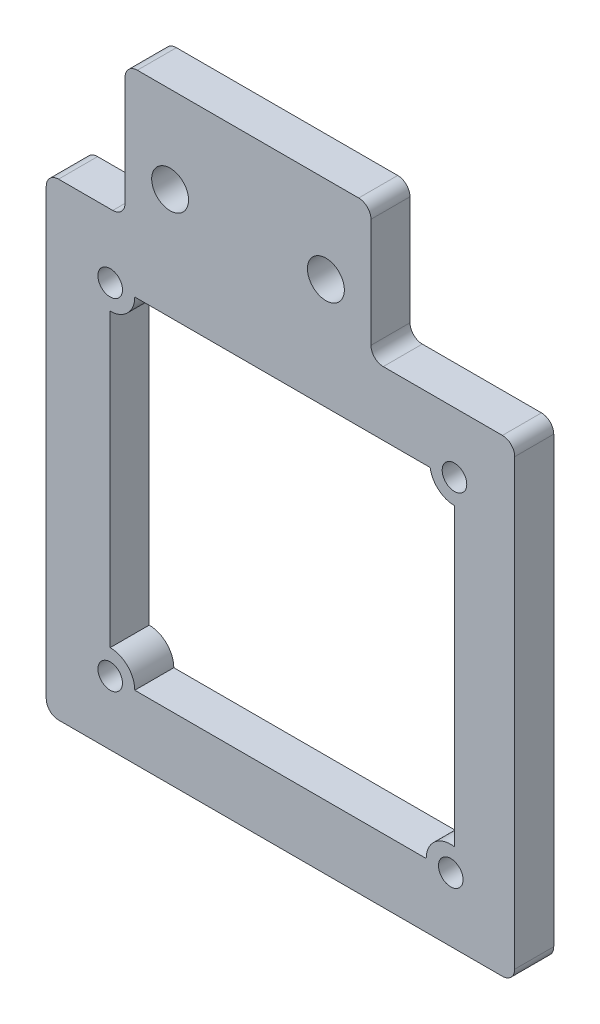
ISO-10303-21;
HEADER;
FILE_DESCRIPTION(('STEP AP214'),'2;1');
FILE_NAME('part.step','',(''),(''),'','','');
FILE_SCHEMA(('AUTOMOTIVE_DESIGN { 1 0 10303 214 1 1 1 1 }'));
ENDSEC;
DATA;
#1=APPLICATION_CONTEXT('core data for automotive mechanical design processes');
#2=APPLICATION_PROTOCOL_DEFINITION('international standard','automotive_design',2000,#1);
#3=PRODUCT_CONTEXT('',#1,'mechanical');
#4=PRODUCT('Part','Part','',(#3));
#5=PRODUCT_RELATED_PRODUCT_CATEGORY('part','',(#4));
#6=PRODUCT_DEFINITION_FORMATION('','',#4);
#7=PRODUCT_DEFINITION_CONTEXT('part definition',#1,'design');
#8=PRODUCT_DEFINITION('design','',#6,#7);
#9=PRODUCT_DEFINITION_SHAPE('','',#8);
#10=(LENGTH_UNIT() NAMED_UNIT(*) SI_UNIT(.MILLI.,.METRE.));
#11=(NAMED_UNIT(*) PLANE_ANGLE_UNIT() SI_UNIT($,.RADIAN.));
#12=(NAMED_UNIT(*) SI_UNIT($,.STERADIAN.) SOLID_ANGLE_UNIT());
#13=UNCERTAINTY_MEASURE_WITH_UNIT(LENGTH_MEASURE(1.E-05),#10,'distance_accuracy_value','');
#14=(GEOMETRIC_REPRESENTATION_CONTEXT(3) GLOBAL_UNCERTAINTY_ASSIGNED_CONTEXT((#13)) GLOBAL_UNIT_ASSIGNED_CONTEXT((#10,
#11,#12)) REPRESENTATION_CONTEXT('',''));
#15=CARTESIAN_POINT('',(0.,0.,0.));
#16=DIRECTION('',(0.,0.,1.));
#17=DIRECTION('',(1.,0.,0.));
#18=AXIS2_PLACEMENT_3D('',#15,#16,#17);
#19=CARTESIAN_POINT('',(0.,0.,3.175));
#20=DIRECTION('',(0.,0.,1.));
#21=DIRECTION('',(1.,0.,0.));
#22=AXIS2_PLACEMENT_3D('',#19,#20,#21);
#23=PLANE('',#22);
#24=CARTESIAN_POINT('',(-1.20910547078258,-5.19999999999999,3.175));
#25=DIRECTION('',(0.,0.,1.));
#26=DIRECTION('',(1.,0.,0.));
#27=AXIS2_PLACEMENT_3D('',#24,#25,#26);
#28=CIRCLE('',#27,1.);
#29=CARTESIAN_POINT('',(-0.209105470782583,-5.19999999999999,3.175));
#30=VERTEX_POINT('',#29);
#31=EDGE_CURVE('E905',#30,#30,#28,.T.);
#32=ORIENTED_EDGE('',*,*,#31,.F.);
#33=EDGE_LOOP('',(#32));
#34=FACE_BOUND('',#33,.T.);
#35=CARTESIAN_POINT('',(3.66495523115076,3.81159322250824,3.175));
#36=DIRECTION('',(0.,0.,1.));
#37=DIRECTION('',(1.,0.,0.));
#38=AXIS2_PLACEMENT_3D('',#35,#36,#37);
#39=CIRCLE('',#38,1.49999999999998);
#40=CARTESIAN_POINT('',(5.16495523115074,3.81159322250824,3.175));
#41=VERTEX_POINT('',#40);
#42=EDGE_CURVE('E590',#41,#41,#39,.T.);
#43=ORIENTED_EDGE('',*,*,#42,.F.);
#44=EDGE_LOOP('',(#43));
#45=FACE_BOUND('',#44,.T.);
#46=CARTESIAN_POINT('',(-1.20910547078258,-32.9,3.175));
#47=DIRECTION('',(0.,0.,1.));
#48=DIRECTION('',(1.,0.,0.));
#49=AXIS2_PLACEMENT_3D('',#46,#47,#48);
#50=CIRCLE('',#49,1.);
#51=CARTESIAN_POINT('',(-0.209105470782583,-32.9,3.175));
#52=VERTEX_POINT('',#51);
#53=EDGE_CURVE('E602',#52,#52,#50,.T.);
#54=ORIENTED_EDGE('',*,*,#53,.F.);
#55=EDGE_LOOP('',(#54));
#56=FACE_BOUND('',#55,.T.);
#57=DIRECTION('',(0.,-1.,0.));
#58=VECTOR('',#57,1.);
#59=CARTESIAN_POINT('',(20.,10.8755385296888,3.175));
#60=LINE('',#59,#58);
#61=CARTESIAN_POINT('',(20.,9.87553852968881,3.175));
#62=VERTEX_POINT('',#61);
#63=CARTESIAN_POINT('',(20.,1.,3.175));
#64=VERTEX_POINT('',#63);
#65=EDGE_CURVE('E628',#62,#64,#60,.T.);
#66=ORIENTED_EDGE('',*,*,#65,.F.);
#67=CARTESIAN_POINT('',(19.,9.87553852968881,3.175));
#68=DIRECTION('',(0.,0.,1.));
#69=DIRECTION('',(1.,0.,0.));
#70=AXIS2_PLACEMENT_3D('',#67,#68,#69);
#71=CIRCLE('',#70,1.);
#72=CARTESIAN_POINT('',(19.,10.8755385296888,3.175));
#73=VERTEX_POINT('',#72);
#74=EDGE_CURVE('E688',#62,#73,#71,.T.);
#75=ORIENTED_EDGE('',*,*,#74,.T.);
#76=DIRECTION('',(-1.,0.,0.));
#77=VECTOR('',#76,1.);
#78=CARTESIAN_POINT('',(20.,10.8755385296888,3.175));
#79=LINE('',#78,#77);
#80=CARTESIAN_POINT('',(1.,10.8755385296888,3.175));
#81=VERTEX_POINT('',#80);
#82=EDGE_CURVE('E608',#73,#81,#79,.T.);
#83=ORIENTED_EDGE('',*,*,#82,.T.);
#84=CARTESIAN_POINT('',(1.,9.87553852968881,3.175));
#85=DIRECTION('',(0.,0.,1.));
#86=DIRECTION('',(1.,0.,0.));
#87=AXIS2_PLACEMENT_3D('',#84,#85,#86);
#88=CIRCLE('',#87,1.);
#89=CARTESIAN_POINT('',(0.,9.87553852968881,3.175));
#90=VERTEX_POINT('',#89);
#91=EDGE_CURVE('E686',#81,#90,#88,.T.);
#92=ORIENTED_EDGE('',*,*,#91,.T.);
#93=DIRECTION('',(0.,-1.,0.));
#94=VECTOR('',#93,1.);
#95=CARTESIAN_POINT('',(0.,10.8755385296888,3.175));
#96=LINE('',#95,#94);
#97=CARTESIAN_POINT('',(0.,1.,3.175));
#98=VERTEX_POINT('',#97);
#99=EDGE_CURVE('E611',#90,#98,#96,.T.);
#100=ORIENTED_EDGE('',*,*,#99,.T.);
#101=CARTESIAN_POINT('',(-1.,1.,3.175));
#102=DIRECTION('',(0.,0.,1.));
#103=DIRECTION('',(1.,0.,0.));
#104=AXIS2_PLACEMENT_3D('',#101,#102,#103);
#105=CIRCLE('',#104,1.);
#106=CARTESIAN_POINT('',(-1.,0.,3.175));
#107=VERTEX_POINT('',#106);
#108=EDGE_CURVE('E12',#98,#107,#105,.F.);
#109=ORIENTED_EDGE('',*,*,#108,.T.);
#110=DIRECTION('',(-1.,0.,0.));
#111=VECTOR('',#110,1.);
#112=CARTESIAN_POINT('',(0.,0.,3.175));
#113=LINE('',#112,#111);
#114=CARTESIAN_POINT('',(-5.40910547078259,0.,3.175));
#115=VERTEX_POINT('',#114);
#116=EDGE_CURVE('E615',#107,#115,#113,.T.);
#117=ORIENTED_EDGE('',*,*,#116,.T.);
#118=CARTESIAN_POINT('',(-5.40910547078259,-0.999999999999994,3.175));
#119=DIRECTION('',(0.,0.,1.));
#120=DIRECTION('',(1.,0.,0.));
#121=AXIS2_PLACEMENT_3D('',#118,#119,#120);
#122=CIRCLE('',#121,1.);
#123=CARTESIAN_POINT('',(-6.40910547078259,-0.999999999999994,3.175));
#124=VERTEX_POINT('',#123);
#125=EDGE_CURVE('E684',#115,#124,#122,.T.);
#126=ORIENTED_EDGE('',*,*,#125,.T.);
#127=DIRECTION('',(0.,-1.,0.));
#128=VECTOR('',#127,1.);
#129=CARTESIAN_POINT('',(-6.40910547078259,0.,3.175));
#130=LINE('',#129,#128);
#131=CARTESIAN_POINT('',(-6.40910547078259,-37.1,3.175));
#132=VERTEX_POINT('',#131);
#133=EDGE_CURVE('E618',#124,#132,#130,.T.);
#134=ORIENTED_EDGE('',*,*,#133,.T.);
#135=CARTESIAN_POINT('',(-5.40910547078259,-37.1,3.175));
#136=DIRECTION('',(0.,0.,1.));
#137=DIRECTION('',(1.,0.,0.));
#138=AXIS2_PLACEMENT_3D('',#135,#136,#137);
#139=CIRCLE('',#138,1.);
#140=CARTESIAN_POINT('',(-5.40910547078259,-38.1,3.175));
#141=VERTEX_POINT('',#140);
#142=EDGE_CURVE('E682',#132,#141,#139,.T.);
#143=ORIENTED_EDGE('',*,*,#142,.T.);
#144=DIRECTION('',(1.,0.,0.));
#145=VECTOR('',#144,1.);
#146=CARTESIAN_POINT('',(-6.40910547078259,-38.1,3.175));
#147=LINE('',#146,#145);
#148=CARTESIAN_POINT('',(30.6908945292174,-38.1,3.175));
#149=VERTEX_POINT('',#148);
#150=EDGE_CURVE('E621',#141,#149,#147,.T.);
#151=ORIENTED_EDGE('',*,*,#150,.T.);
#152=CARTESIAN_POINT('',(30.6908945292174,-37.1,3.175));
#153=DIRECTION('',(0.,0.,1.));
#154=DIRECTION('',(1.,0.,0.));
#155=AXIS2_PLACEMENT_3D('',#152,#153,#154);
#156=CIRCLE('',#155,1.);
#157=CARTESIAN_POINT('',(31.6908945292174,-37.1,3.175));
#158=VERTEX_POINT('',#157);
#159=EDGE_CURVE('E372',#149,#158,#156,.T.);
#160=ORIENTED_EDGE('',*,*,#159,.T.);
#161=DIRECTION('',(0.,1.,0.));
#162=VECTOR('',#161,1.);
#163=CARTESIAN_POINT('',(31.6908945292174,-38.1,3.175));
#164=LINE('',#163,#162);
#165=CARTESIAN_POINT('',(31.6908945292174,-0.999999999999987,3.175));
#166=VERTEX_POINT('',#165);
#167=EDGE_CURVE('E623',#158,#166,#164,.T.);
#168=ORIENTED_EDGE('',*,*,#167,.T.);
#169=CARTESIAN_POINT('',(30.6908945292174,-0.99999999999999,3.175));
#170=DIRECTION('',(0.,0.,1.));
#171=DIRECTION('',(1.,0.,0.));
#172=AXIS2_PLACEMENT_3D('',#169,#170,#171);
#173=CIRCLE('',#172,1.);
#174=CARTESIAN_POINT('',(30.6908945292174,0.,3.175));
#175=VERTEX_POINT('',#174);
#176=EDGE_CURVE('E680',#166,#175,#173,.T.);
#177=ORIENTED_EDGE('',*,*,#176,.T.);
#178=DIRECTION('',(-1.,0.,0.));
#179=VECTOR('',#178,1.);
#180=CARTESIAN_POINT('',(31.6908945292174,0.,3.175));
#181=LINE('',#180,#179);
#182=CARTESIAN_POINT('',(21.,0.,3.175));
#183=VERTEX_POINT('',#182);
#184=EDGE_CURVE('E625',#175,#183,#181,.T.);
#185=ORIENTED_EDGE('',*,*,#184,.T.);
#186=CARTESIAN_POINT('',(21.,1.,3.175));
#187=DIRECTION('',(0.,0.,1.));
#188=DIRECTION('',(1.,0.,0.));
#189=AXIS2_PLACEMENT_3D('',#186,#187,#188);
#190=CIRCLE('',#189,1.);
#191=EDGE_CURVE('E716',#183,#64,#190,.F.);
#192=ORIENTED_EDGE('',*,*,#191,.T.);
#193=EDGE_LOOP('',(#66,#75,#83,#92,#100,#109,#117,#126,#134,#143,#151,#160,#168,#177,#185,#192));
#194=FACE_BOUND('',#193,.T.);
#195=CARTESIAN_POINT('',(26.4908945292174,-32.9,3.175));
#196=DIRECTION('',(0.,0.,1.));
#197=DIRECTION('',(1.,0.,0.));
#198=AXIS2_PLACEMENT_3D('',#195,#196,#197);
#199=CIRCLE('',#198,1.);
#200=CARTESIAN_POINT('',(27.4908945292174,-32.9,3.175));
#201=VERTEX_POINT('',#200);
#202=EDGE_CURVE('E596',#201,#201,#199,.T.);
#203=ORIENTED_EDGE('',*,*,#202,.F.);
#204=EDGE_LOOP('',(#203));
#205=FACE_BOUND('',#204,.T.);
#206=CARTESIAN_POINT('',(-1.20910547078258,-5.19999999999999,3.175));
#207=DIRECTION('',(0.,0.,1.));
#208=DIRECTION('',(1.,0.,0.));
#209=AXIS2_PLACEMENT_3D('',#206,#207,#208);
#210=CIRCLE('',#209,2.);
#211=CARTESIAN_POINT('',(-1.20910547078258,-7.19999999999999,3.175));
#212=VERTEX_POINT('',#211);
#213=CARTESIAN_POINT('',(0.790894529217419,-5.19999999999999,3.175));
#214=VERTEX_POINT('',#213);
#215=EDGE_CURVE('E524',#212,#214,#210,.T.);
#216=ORIENTED_EDGE('',*,*,#215,.T.);
#217=DIRECTION('',(-1.,0.,0.));
#218=VECTOR('',#217,1.);
#219=CARTESIAN_POINT('',(24.8135225358889,-5.19999999999998,3.175));
#220=LINE('',#219,#218);
#221=CARTESIAN_POINT('',(24.8135225358889,-5.19999999999998,3.175));
#222=VERTEX_POINT('',#221);
#223=EDGE_CURVE('E512',#222,#214,#220,.T.);
#224=ORIENTED_EDGE('',*,*,#223,.F.);
#225=CARTESIAN_POINT('',(26.7908945292174,-4.89999999999999,3.175));
#226=DIRECTION('',(0.,0.,-1.));
#227=DIRECTION('',(-1.,0.,0.));
#228=AXIS2_PLACEMENT_3D('',#225,#226,#227);
#229=CIRCLE('',#228,2.);
#230=CARTESIAN_POINT('',(26.7908945292174,-6.89999999999999,3.175));
#231=VERTEX_POINT('',#230);
#232=EDGE_CURVE('E523',#231,#222,#229,.T.);
#233=ORIENTED_EDGE('',*,*,#232,.F.);
#234=DIRECTION('',(0.,-1.,0.));
#235=VECTOR('',#234,1.);
#236=CARTESIAN_POINT('',(26.7908945292174,-6.89999999999999,3.175));
#237=LINE('',#236,#235);
#238=CARTESIAN_POINT('',(26.7908945292174,-30.9226280066715,3.175));
#239=VERTEX_POINT('',#238);
#240=EDGE_CURVE('E546',#231,#239,#237,.T.);
#241=ORIENTED_EDGE('',*,*,#240,.T.);
#242=CARTESIAN_POINT('',(26.4908945292174,-32.9,3.175));
#243=DIRECTION('',(0.,0.,1.));
#244=DIRECTION('',(1.,0.,0.));
#245=AXIS2_PLACEMENT_3D('',#242,#243,#244);
#246=CIRCLE('',#245,2.);
#247=CARTESIAN_POINT('',(24.4908945292174,-32.9,3.175));
#248=VERTEX_POINT('',#247);
#249=EDGE_CURVE('E549',#239,#248,#246,.T.);
#250=ORIENTED_EDGE('',*,*,#249,.T.);
#251=DIRECTION('',(-1.,0.,0.));
#252=VECTOR('',#251,1.);
#253=CARTESIAN_POINT('',(24.4908945292174,-32.9,3.175));
#254=LINE('',#253,#252);
#255=CARTESIAN_POINT('',(0.790894529217418,-32.9,3.175));
#256=VERTEX_POINT('',#255);
#257=EDGE_CURVE('E552',#248,#256,#254,.T.);
#258=ORIENTED_EDGE('',*,*,#257,.T.);
#259=CARTESIAN_POINT('',(-1.20910547078258,-32.9,3.175));
#260=DIRECTION('',(0.,0.,1.));
#261=DIRECTION('',(1.,0.,0.));
#262=AXIS2_PLACEMENT_3D('',#259,#260,#261);
#263=CIRCLE('',#262,2.);
#264=CARTESIAN_POINT('',(-1.20910547078258,-30.9,3.175));
#265=VERTEX_POINT('',#264);
#266=EDGE_CURVE('E555',#256,#265,#263,.T.);
#267=ORIENTED_EDGE('',*,*,#266,.T.);
#268=DIRECTION('',(0.,-1.,0.));
#269=VECTOR('',#268,1.);
#270=CARTESIAN_POINT('',(-1.20910547078258,-7.19999999999999,3.175));
#271=LINE('',#270,#269);
#272=EDGE_CURVE('E532',#212,#265,#271,.T.);
#273=ORIENTED_EDGE('',*,*,#272,.F.);
#274=EDGE_LOOP('',(#216,#224,#233,#241,#250,#258,#267,#273));
#275=FACE_BOUND('',#274,.T.);
#276=CARTESIAN_POINT('',(26.7908945292174,-4.89999999999999,3.175));
#277=DIRECTION('',(0.,0.,1.));
#278=DIRECTION('',(1.,0.,0.));
#279=AXIS2_PLACEMENT_3D('',#276,#277,#278);
#280=CIRCLE('',#279,1.);
#281=CARTESIAN_POINT('',(27.7908945292174,-4.89999999999999,3.175));
#282=VERTEX_POINT('',#281);
#283=EDGE_CURVE('E560',#282,#282,#280,.T.);
#284=ORIENTED_EDGE('',*,*,#283,.F.);
#285=EDGE_LOOP('',(#284));
#286=FACE_BOUND('',#285,.T.);
#287=CARTESIAN_POINT('',(16.3350447688493,3.81159322250824,3.175));
#288=DIRECTION('',(0.,0.,1.));
#289=DIRECTION('',(1.,0.,0.));
#290=AXIS2_PLACEMENT_3D('',#287,#288,#289);
#291=CIRCLE('',#290,1.5);
#292=CARTESIAN_POINT('',(17.8350447688493,3.81159322250824,3.175));
#293=VERTEX_POINT('',#292);
#294=EDGE_CURVE('E901',#293,#293,#291,.T.);
#295=ORIENTED_EDGE('',*,*,#294,.F.);
#296=EDGE_LOOP('',(#295));
#297=FACE_BOUND('',#296,.T.);
#298=ADVANCED_FACE('F350',(#34,#45,#56,#194,#205,#275,#286,#297),#23,.T.);
#299=CARTESIAN_POINT('',(0.,0.,0.));
#300=DIRECTION('',(0.,0.,1.));
#301=DIRECTION('',(1.,0.,0.));
#302=AXIS2_PLACEMENT_3D('',#299,#300,#301);
#303=PLANE('',#302);
#304=DIRECTION('',(-1.,0.,0.));
#305=VECTOR('',#304,1.);
#306=CARTESIAN_POINT('',(24.8135225358889,-5.19999999999998,0.));
#307=LINE('',#306,#305);
#308=CARTESIAN_POINT('',(24.8135225358889,-5.19999999999999,0.));
#309=VERTEX_POINT('',#308);
#310=CARTESIAN_POINT('',(0.790894529217419,-5.19999999999999,0.));
#311=VERTEX_POINT('',#310);
#312=EDGE_CURVE('E559',#309,#311,#307,.T.);
#313=ORIENTED_EDGE('',*,*,#312,.T.);
#314=CARTESIAN_POINT('',(-1.20910547078258,-5.19999999999999,0.));
#315=DIRECTION('',(0.,0.,1.));
#316=DIRECTION('',(1.,0.,0.));
#317=AXIS2_PLACEMENT_3D('',#314,#315,#316);
#318=CIRCLE('',#317,2.);
#319=CARTESIAN_POINT('',(-1.20910547078258,-7.19999999999999,0.));
#320=VERTEX_POINT('',#319);
#321=EDGE_CURVE('E531',#320,#311,#318,.T.);
#322=ORIENTED_EDGE('',*,*,#321,.F.);
#323=DIRECTION('',(0.,-1.,0.));
#324=VECTOR('',#323,1.);
#325=CARTESIAN_POINT('',(-1.20910547078258,-7.19999999999999,0.));
#326=LINE('',#325,#324);
#327=CARTESIAN_POINT('',(-1.20910547078258,-30.9,0.));
#328=VERTEX_POINT('',#327);
#329=EDGE_CURVE('E536',#320,#328,#326,.T.);
#330=ORIENTED_EDGE('',*,*,#329,.T.);
#331=CARTESIAN_POINT('',(-1.20910547078258,-32.9,0.));
#332=DIRECTION('',(0.,0.,1.));
#333=DIRECTION('',(1.,0.,0.));
#334=AXIS2_PLACEMENT_3D('',#331,#332,#333);
#335=CIRCLE('',#334,2.);
#336=CARTESIAN_POINT('',(0.790894529217418,-32.9,0.));
#337=VERTEX_POINT('',#336);
#338=EDGE_CURVE('E539',#337,#328,#335,.T.);
#339=ORIENTED_EDGE('',*,*,#338,.F.);
#340=DIRECTION('',(-1.,0.,0.));
#341=VECTOR('',#340,1.);
#342=CARTESIAN_POINT('',(24.4908945292174,-32.9,0.));
#343=LINE('',#342,#341);
#344=CARTESIAN_POINT('',(24.4908945292174,-32.9,0.));
#345=VERTEX_POINT('',#344);
#346=EDGE_CURVE('E571',#345,#337,#343,.T.);
#347=ORIENTED_EDGE('',*,*,#346,.F.);
#348=CARTESIAN_POINT('',(26.4908945292174,-32.9,0.));
#349=DIRECTION('',(0.,0.,1.));
#350=DIRECTION('',(1.,0.,0.));
#351=AXIS2_PLACEMENT_3D('',#348,#349,#350);
#352=CIRCLE('',#351,2.);
#353=CARTESIAN_POINT('',(26.7908945292174,-30.9226280066715,0.));
#354=VERTEX_POINT('',#353);
#355=EDGE_CURVE('E568',#354,#345,#352,.T.);
#356=ORIENTED_EDGE('',*,*,#355,.F.);
#357=DIRECTION('',(0.,-1.,0.));
#358=VECTOR('',#357,1.);
#359=CARTESIAN_POINT('',(26.7908945292174,-6.89999999999999,0.));
#360=LINE('',#359,#358);
#361=CARTESIAN_POINT('',(26.7908945292174,-6.89999999999999,0.));
#362=VERTEX_POINT('',#361);
#363=EDGE_CURVE('E565',#362,#354,#360,.T.);
#364=ORIENTED_EDGE('',*,*,#363,.F.);
#365=CARTESIAN_POINT('',(26.7908945292174,-4.89999999999999,0.));
#366=DIRECTION('',(0.,0.,-1.));
#367=DIRECTION('',(-1.,0.,0.));
#368=AXIS2_PLACEMENT_3D('',#365,#366,#367);
#369=CIRCLE('',#368,2.);
#370=EDGE_CURVE('E562',#362,#309,#369,.T.);
#371=ORIENTED_EDGE('',*,*,#370,.T.);
#372=EDGE_LOOP('',(#313,#322,#330,#339,#347,#356,#364,#371));
#373=FACE_BOUND('',#372,.T.);
#374=DIRECTION('',(-1.,0.,0.));
#375=VECTOR('',#374,1.);
#376=CARTESIAN_POINT('',(20.,10.8755385296888,0.));
#377=LINE('',#376,#375);
#378=CARTESIAN_POINT('',(19.,10.8755385296888,0.));
#379=VERTEX_POINT('',#378);
#380=CARTESIAN_POINT('',(1.,10.8755385296888,0.));
#381=VERTEX_POINT('',#380);
#382=EDGE_CURVE('E605',#379,#381,#377,.T.);
#383=ORIENTED_EDGE('',*,*,#382,.F.);
#384=CARTESIAN_POINT('',(19.,9.87553852968881,0.));
#385=DIRECTION('',(0.,0.,1.));
#386=DIRECTION('',(1.,0.,0.));
#387=AXIS2_PLACEMENT_3D('',#384,#385,#386);
#388=CIRCLE('',#387,1.);
#389=CARTESIAN_POINT('',(20.,9.87553852968881,0.));
#390=VERTEX_POINT('',#389);
#391=EDGE_CURVE('E677',#379,#390,#388,.F.);
#392=ORIENTED_EDGE('',*,*,#391,.T.);
#393=DIRECTION('',(0.,-1.,0.));
#394=VECTOR('',#393,1.);
#395=CARTESIAN_POINT('',(20.,10.8755385296888,0.));
#396=LINE('',#395,#394);
#397=CARTESIAN_POINT('',(20.,1.,0.));
#398=VERTEX_POINT('',#397);
#399=EDGE_CURVE('E612',#390,#398,#396,.T.);
#400=ORIENTED_EDGE('',*,*,#399,.T.);
#401=CARTESIAN_POINT('',(21.,1.,0.));
#402=DIRECTION('',(0.,0.,1.));
#403=DIRECTION('',(1.,0.,0.));
#404=AXIS2_PLACEMENT_3D('',#401,#402,#403);
#405=CIRCLE('',#404,1.);
#406=CARTESIAN_POINT('',(21.,0.,0.));
#407=VERTEX_POINT('',#406);
#408=EDGE_CURVE('E714',#398,#407,#405,.T.);
#409=ORIENTED_EDGE('',*,*,#408,.T.);
#410=DIRECTION('',(-1.,0.,0.));
#411=VECTOR('',#410,1.);
#412=CARTESIAN_POINT('',(31.6908945292174,0.,0.));
#413=LINE('',#412,#411);
#414=CARTESIAN_POINT('',(30.6908945292174,0.,0.));
#415=VERTEX_POINT('',#414);
#416=EDGE_CURVE('E648',#415,#407,#413,.T.);
#417=ORIENTED_EDGE('',*,*,#416,.F.);
#418=CARTESIAN_POINT('',(30.6908945292174,-0.99999999999999,0.));
#419=DIRECTION('',(0.,0.,1.));
#420=DIRECTION('',(1.,0.,0.));
#421=AXIS2_PLACEMENT_3D('',#418,#419,#420);
#422=CIRCLE('',#421,1.);
#423=CARTESIAN_POINT('',(31.6908945292174,-0.999999999999987,0.));
#424=VERTEX_POINT('',#423);
#425=EDGE_CURVE('E669',#415,#424,#422,.F.);
#426=ORIENTED_EDGE('',*,*,#425,.T.);
#427=DIRECTION('',(0.,1.,0.));
#428=VECTOR('',#427,1.);
#429=CARTESIAN_POINT('',(31.6908945292174,-38.1,0.));
#430=LINE('',#429,#428);
#431=CARTESIAN_POINT('',(31.6908945292174,-37.1,0.));
#432=VERTEX_POINT('',#431);
#433=EDGE_CURVE('E646',#432,#424,#430,.T.);
#434=ORIENTED_EDGE('',*,*,#433,.F.);
#435=CARTESIAN_POINT('',(30.6908945292174,-37.1,0.));
#436=DIRECTION('',(0.,0.,1.));
#437=DIRECTION('',(1.,0.,0.));
#438=AXIS2_PLACEMENT_3D('',#435,#436,#437);
#439=CIRCLE('',#438,1.);
#440=CARTESIAN_POINT('',(30.6908945292174,-38.1,0.));
#441=VERTEX_POINT('',#440);
#442=EDGE_CURVE('E667',#432,#441,#439,.F.);
#443=ORIENTED_EDGE('',*,*,#442,.T.);
#444=DIRECTION('',(1.,0.,0.));
#445=VECTOR('',#444,1.);
#446=CARTESIAN_POINT('',(-6.40910547078259,-38.1,0.));
#447=LINE('',#446,#445);
#448=CARTESIAN_POINT('',(-5.40910547078259,-38.1,0.));
#449=VERTEX_POINT('',#448);
#450=EDGE_CURVE('E643',#449,#441,#447,.T.);
#451=ORIENTED_EDGE('',*,*,#450,.F.);
#452=CARTESIAN_POINT('',(-5.40910547078259,-37.1,0.));
#453=DIRECTION('',(0.,0.,1.));
#454=DIRECTION('',(1.,0.,0.));
#455=AXIS2_PLACEMENT_3D('',#452,#453,#454);
#456=CIRCLE('',#455,1.);
#457=CARTESIAN_POINT('',(-6.40910547078259,-37.1,0.));
#458=VERTEX_POINT('',#457);
#459=EDGE_CURVE('E671',#449,#458,#456,.F.);
#460=ORIENTED_EDGE('',*,*,#459,.T.);
#461=DIRECTION('',(0.,-1.,0.));
#462=VECTOR('',#461,1.);
#463=CARTESIAN_POINT('',(-6.40910547078259,0.,0.));
#464=LINE('',#463,#462);
#465=CARTESIAN_POINT('',(-6.40910547078259,-0.999999999999994,0.));
#466=VERTEX_POINT('',#465);
#467=EDGE_CURVE('E640',#466,#458,#464,.T.);
#468=ORIENTED_EDGE('',*,*,#467,.F.);
#469=CARTESIAN_POINT('',(-5.40910547078259,-0.999999999999994,0.));
#470=DIRECTION('',(0.,0.,1.));
#471=DIRECTION('',(1.,0.,0.));
#472=AXIS2_PLACEMENT_3D('',#469,#470,#471);
#473=CIRCLE('',#472,1.);
#474=CARTESIAN_POINT('',(-5.40910547078259,0.,0.));
#475=VERTEX_POINT('',#474);
#476=EDGE_CURVE('E673',#466,#475,#473,.F.);
#477=ORIENTED_EDGE('',*,*,#476,.T.);
#478=DIRECTION('',(-1.,0.,0.));
#479=VECTOR('',#478,1.);
#480=CARTESIAN_POINT('',(0.,0.,0.));
#481=LINE('',#480,#479);
#482=CARTESIAN_POINT('',(-1.,0.,0.));
#483=VERTEX_POINT('',#482);
#484=EDGE_CURVE('E637',#483,#475,#481,.T.);
#485=ORIENTED_EDGE('',*,*,#484,.F.);
#486=CARTESIAN_POINT('',(-1.,1.,0.));
#487=DIRECTION('',(0.,0.,1.));
#488=DIRECTION('',(1.,0.,0.));
#489=AXIS2_PLACEMENT_3D('',#486,#487,#488);
#490=CIRCLE('',#489,1.);
#491=CARTESIAN_POINT('',(0.,1.,0.));
#492=VERTEX_POINT('',#491);
#493=EDGE_CURVE('E358',#483,#492,#490,.T.);
#494=ORIENTED_EDGE('',*,*,#493,.T.);
#495=DIRECTION('',(0.,-1.,0.));
#496=VECTOR('',#495,1.);
#497=CARTESIAN_POINT('',(0.,10.8755385296888,0.));
#498=LINE('',#497,#496);
#499=CARTESIAN_POINT('',(0.,9.87553852968881,0.));
#500=VERTEX_POINT('',#499);
#501=EDGE_CURVE('E634',#500,#492,#498,.T.);
#502=ORIENTED_EDGE('',*,*,#501,.F.);
#503=CARTESIAN_POINT('',(1.,9.87553852968881,0.));
#504=DIRECTION('',(0.,0.,1.));
#505=DIRECTION('',(1.,0.,0.));
#506=AXIS2_PLACEMENT_3D('',#503,#504,#505);
#507=CIRCLE('',#506,1.);
#508=EDGE_CURVE('E675',#500,#381,#507,.F.);
#509=ORIENTED_EDGE('',*,*,#508,.T.);
#510=EDGE_LOOP('',(#383,#392,#400,#409,#417,#426,#434,#443,#451,#460,#468,#477,#485,#494,#502,#509));
#511=FACE_BOUND('',#510,.T.);
#512=CARTESIAN_POINT('',(-1.20910547078258,-32.9,0.));
#513=DIRECTION('',(0.,0.,1.));
#514=DIRECTION('',(1.,0.,0.));
#515=AXIS2_PLACEMENT_3D('',#512,#513,#514);
#516=CIRCLE('',#515,1.);
#517=CARTESIAN_POINT('',(-0.209105470782583,-32.9,0.));
#518=VERTEX_POINT('',#517);
#519=EDGE_CURVE('E599',#518,#518,#516,.T.);
#520=ORIENTED_EDGE('',*,*,#519,.T.);
#521=EDGE_LOOP('',(#520));
#522=FACE_BOUND('',#521,.T.);
#523=CARTESIAN_POINT('',(26.4908945292174,-32.9,0.));
#524=DIRECTION('',(0.,0.,1.));
#525=DIRECTION('',(1.,0.,0.));
#526=AXIS2_PLACEMENT_3D('',#523,#524,#525);
#527=CIRCLE('',#526,1.);
#528=CARTESIAN_POINT('',(27.4908945292174,-32.9,0.));
#529=VERTEX_POINT('',#528);
#530=EDGE_CURVE('E593',#529,#529,#527,.T.);
#531=ORIENTED_EDGE('',*,*,#530,.T.);
#532=EDGE_LOOP('',(#531));
#533=FACE_BOUND('',#532,.T.);
#534=CARTESIAN_POINT('',(3.66495523115076,3.81159322250824,0.));
#535=DIRECTION('',(0.,0.,1.));
#536=DIRECTION('',(1.,0.,0.));
#537=AXIS2_PLACEMENT_3D('',#534,#535,#536);
#538=CIRCLE('',#537,1.49999999999998);
#539=CARTESIAN_POINT('',(5.16495523115074,3.81159322250824,0.));
#540=VERTEX_POINT('',#539);
#541=EDGE_CURVE('E578',#540,#540,#538,.T.);
#542=ORIENTED_EDGE('',*,*,#541,.T.);
#543=EDGE_LOOP('',(#542));
#544=FACE_BOUND('',#543,.T.);
#545=CARTESIAN_POINT('',(26.7908945292174,-4.89999999999999,0.));
#546=DIRECTION('',(0.,0.,1.));
#547=DIRECTION('',(1.,0.,0.));
#548=AXIS2_PLACEMENT_3D('',#545,#546,#547);
#549=CIRCLE('',#548,1.);
#550=CARTESIAN_POINT('',(27.7908945292174,-4.89999999999999,0.));
#551=VERTEX_POINT('',#550);
#552=EDGE_CURVE('E542',#551,#551,#549,.T.);
#553=ORIENTED_EDGE('',*,*,#552,.T.);
#554=EDGE_LOOP('',(#553));
#555=FACE_BOUND('',#554,.T.);
#556=CARTESIAN_POINT('',(-1.20910547078258,-5.19999999999999,0.));
#557=DIRECTION('',(0.,0.,1.));
#558=DIRECTION('',(1.,0.,0.));
#559=AXIS2_PLACEMENT_3D('',#556,#557,#558);
#560=CIRCLE('',#559,1.);
#561=CARTESIAN_POINT('',(-0.209105470782583,-5.19999999999999,0.));
#562=VERTEX_POINT('',#561);
#563=EDGE_CURVE('E897',#562,#562,#560,.T.);
#564=ORIENTED_EDGE('',*,*,#563,.T.);
#565=EDGE_LOOP('',(#564));
#566=FACE_BOUND('',#565,.T.);
#567=CARTESIAN_POINT('',(16.3350447688493,3.81159322250824,0.));
#568=DIRECTION('',(0.,0.,1.));
#569=DIRECTION('',(1.,0.,0.));
#570=AXIS2_PLACEMENT_3D('',#567,#568,#569);
#571=CIRCLE('',#570,1.5);
#572=CARTESIAN_POINT('',(17.8350447688493,3.81159322250824,0.));
#573=VERTEX_POINT('',#572);
#574=EDGE_CURVE('E900',#573,#573,#571,.T.);
#575=ORIENTED_EDGE('',*,*,#574,.T.);
#576=EDGE_LOOP('',(#575));
#577=FACE_BOUND('',#576,.T.);
#578=ADVANCED_FACE('F721',(#373,#511,#522,#533,#544,#555,#566,#577),#303,.F.);
#579=CARTESIAN_POINT('',(20.,10.8755385296888,3.175));
#580=DIRECTION('',(0.,-1.,0.));
#581=DIRECTION('',(0.,0.,-1.));
#582=AXIS2_PLACEMENT_3D('',#579,#580,#581);
#583=PLANE('',#582);
#584=ORIENTED_EDGE('',*,*,#82,.F.);
#585=DIRECTION('',(0.,0.,-1.));
#586=VECTOR('',#585,1.);
#587=CARTESIAN_POINT('',(19.,10.8755385296888,0.));
#588=LINE('',#587,#586);
#589=EDGE_CURVE('E664',#73,#379,#588,.T.);
#590=ORIENTED_EDGE('',*,*,#589,.T.);
#591=ORIENTED_EDGE('',*,*,#382,.T.);
#592=DIRECTION('',(0.,0.,-1.));
#593=VECTOR('',#592,1.);
#594=CARTESIAN_POINT('',(1.,10.8755385296888,3.175));
#595=LINE('',#594,#593);
#596=EDGE_CURVE('E662',#381,#81,#595,.F.);
#597=ORIENTED_EDGE('',*,*,#596,.T.);
#598=EDGE_LOOP('',(#584,#590,#591,#597));
#599=FACE_BOUND('',#598,.T.);
#600=ADVANCED_FACE('F783',(#599),#583,.F.);
#601=CARTESIAN_POINT('',(0.,10.8755385296888,3.175));
#602=DIRECTION('',(1.,0.,0.));
#603=DIRECTION('',(0.,1.,0.));
#604=AXIS2_PLACEMENT_3D('',#601,#602,#603);
#605=PLANE('',#604);
#606=ORIENTED_EDGE('',*,*,#99,.F.);
#607=DIRECTION('',(0.,0.,-1.));
#608=VECTOR('',#607,1.);
#609=CARTESIAN_POINT('',(0.,9.87553852968881,3.175));
#610=LINE('',#609,#608);
#611=EDGE_CURVE('E692',#90,#500,#610,.T.);
#612=ORIENTED_EDGE('',*,*,#611,.T.);
#613=ORIENTED_EDGE('',*,*,#501,.T.);
#614=DIRECTION('',(0.,0.,-1.));
#615=VECTOR('',#614,1.);
#616=CARTESIAN_POINT('',(0.,1.,3.175));
#617=LINE('',#616,#615);
#618=EDGE_CURVE('E690',#492,#98,#617,.F.);
#619=ORIENTED_EDGE('',*,*,#618,.T.);
#620=EDGE_LOOP('',(#606,#612,#613,#619));
#621=FACE_BOUND('',#620,.T.);
#622=ADVANCED_FACE('F728',(#621),#605,.F.);
#623=CARTESIAN_POINT('',(0.,0.,3.175));
#624=DIRECTION('',(0.,-1.,0.));
#625=DIRECTION('',(1.,0.,0.));
#626=AXIS2_PLACEMENT_3D('',#623,#624,#625);
#627=PLANE('',#626);
#628=ORIENTED_EDGE('',*,*,#116,.F.);
#629=DIRECTION('',(0.,0.,-1.));
#630=VECTOR('',#629,1.);
#631=CARTESIAN_POINT('',(-1.,0.,0.));
#632=LINE('',#631,#630);
#633=EDGE_CURVE('E697',#107,#483,#632,.T.);
#634=ORIENTED_EDGE('',*,*,#633,.T.);
#635=ORIENTED_EDGE('',*,*,#484,.T.);
#636=DIRECTION('',(0.,0.,-1.));
#637=VECTOR('',#636,1.);
#638=CARTESIAN_POINT('',(-5.40910547078259,0.,3.175));
#639=LINE('',#638,#637);
#640=EDGE_CURVE('E695',#475,#115,#639,.F.);
#641=ORIENTED_EDGE('',*,*,#640,.T.);
#642=EDGE_LOOP('',(#628,#634,#635,#641));
#643=FACE_BOUND('',#642,.T.);
#644=ADVANCED_FACE('F737',(#643),#627,.F.);
#645=CARTESIAN_POINT('',(-6.40910547078259,0.,3.175));
#646=DIRECTION('',(1.,0.,0.));
#647=DIRECTION('',(0.,0.,-1.));
#648=AXIS2_PLACEMENT_3D('',#645,#646,#647);
#649=PLANE('',#648);
#650=ORIENTED_EDGE('',*,*,#133,.F.);
#651=DIRECTION('',(0.,0.,-1.));
#652=VECTOR('',#651,1.);
#653=CARTESIAN_POINT('',(-6.40910547078259,-0.999999999999994,3.175));
#654=LINE('',#653,#652);
#655=EDGE_CURVE('E702',#124,#466,#654,.T.);
#656=ORIENTED_EDGE('',*,*,#655,.T.);
#657=ORIENTED_EDGE('',*,*,#467,.T.);
#658=DIRECTION('',(0.,0.,-1.));
#659=VECTOR('',#658,1.);
#660=CARTESIAN_POINT('',(-6.40910547078259,-37.1,3.175));
#661=LINE('',#660,#659);
#662=EDGE_CURVE('E700',#458,#132,#661,.F.);
#663=ORIENTED_EDGE('',*,*,#662,.T.);
#664=EDGE_LOOP('',(#650,#656,#657,#663));
#665=FACE_BOUND('',#664,.T.);
#666=ADVANCED_FACE('F745',(#665),#649,.F.);
#667=CARTESIAN_POINT('',(-6.40910547078259,-38.1,3.175));
#668=DIRECTION('',(0.,1.,0.));
#669=DIRECTION('',(0.,0.,1.));
#670=AXIS2_PLACEMENT_3D('',#667,#668,#669);
#671=PLANE('',#670);
#672=ORIENTED_EDGE('',*,*,#150,.F.);
#673=DIRECTION('',(0.,0.,-1.));
#674=VECTOR('',#673,1.);
#675=CARTESIAN_POINT('',(-5.40910547078259,-38.1,3.175));
#676=LINE('',#675,#674);
#677=EDGE_CURVE('E707',#141,#449,#676,.T.);
#678=ORIENTED_EDGE('',*,*,#677,.T.);
#679=ORIENTED_EDGE('',*,*,#450,.T.);
#680=DIRECTION('',(0.,0.,-1.));
#681=VECTOR('',#680,1.);
#682=CARTESIAN_POINT('',(30.6908945292174,-38.1,3.175));
#683=LINE('',#682,#681);
#684=EDGE_CURVE('E705',#441,#149,#683,.F.);
#685=ORIENTED_EDGE('',*,*,#684,.T.);
#686=EDGE_LOOP('',(#672,#678,#679,#685));
#687=FACE_BOUND('',#686,.T.);
#688=ADVANCED_FACE('F753',(#687),#671,.F.);
#689=CARTESIAN_POINT('',(31.6908945292174,-38.1,3.175));
#690=DIRECTION('',(-1.,0.,0.));
#691=DIRECTION('',(0.,0.,1.));
#692=AXIS2_PLACEMENT_3D('',#689,#690,#691);
#693=PLANE('',#692);
#694=ORIENTED_EDGE('',*,*,#433,.T.);
#695=DIRECTION('',(0.,0.,-1.));
#696=VECTOR('',#695,1.);
#697=CARTESIAN_POINT('',(31.6908945292174,-0.999999999999987,3.175));
#698=LINE('',#697,#696);
#699=EDGE_CURVE('E365',#424,#166,#698,.F.);
#700=ORIENTED_EDGE('',*,*,#699,.T.);
#701=ORIENTED_EDGE('',*,*,#167,.F.);
#702=DIRECTION('',(0.,0.,-1.));
#703=VECTOR('',#702,1.);
#704=CARTESIAN_POINT('',(31.6908945292174,-37.1,3.175));
#705=LINE('',#704,#703);
#706=EDGE_CURVE('E710',#158,#432,#705,.T.);
#707=ORIENTED_EDGE('',*,*,#706,.T.);
#708=EDGE_LOOP('',(#694,#700,#701,#707));
#709=FACE_BOUND('',#708,.T.);
#710=ADVANCED_FACE('F759',(#709),#693,.F.);
#711=CARTESIAN_POINT('',(31.6908945292174,0.,3.175));
#712=DIRECTION('',(0.,-1.,0.));
#713=DIRECTION('',(1.,0.,0.));
#714=AXIS2_PLACEMENT_3D('',#711,#712,#713);
#715=PLANE('',#714);
#716=ORIENTED_EDGE('',*,*,#416,.T.);
#717=DIRECTION('',(0.,0.,-1.));
#718=VECTOR('',#717,1.);
#719=CARTESIAN_POINT('',(21.,0.,3.175));
#720=LINE('',#719,#718);
#721=EDGE_CURVE('E660',#407,#183,#720,.F.);
#722=ORIENTED_EDGE('',*,*,#721,.T.);
#723=ORIENTED_EDGE('',*,*,#184,.F.);
#724=DIRECTION('',(0.,0.,-1.));
#725=VECTOR('',#724,1.);
#726=CARTESIAN_POINT('',(30.6908945292174,0.,3.175));
#727=LINE('',#726,#725);
#728=EDGE_CURVE('E657',#175,#415,#727,.T.);
#729=ORIENTED_EDGE('',*,*,#728,.T.);
#730=EDGE_LOOP('',(#716,#722,#723,#729));
#731=FACE_BOUND('',#730,.T.);
#732=ADVANCED_FACE('F767',(#731),#715,.F.);
#733=CARTESIAN_POINT('',(20.,10.8755385296888,3.175));
#734=DIRECTION('',(1.,0.,0.));
#735=DIRECTION('',(0.,0.,-1.));
#736=AXIS2_PLACEMENT_3D('',#733,#734,#735);
#737=PLANE('',#736);
#738=ORIENTED_EDGE('',*,*,#65,.T.);
#739=DIRECTION('',(0.,0.,-1.));
#740=VECTOR('',#739,1.);
#741=CARTESIAN_POINT('',(20.,1.,3.175));
#742=LINE('',#741,#740);
#743=EDGE_CURVE('E654',#64,#398,#742,.T.);
#744=ORIENTED_EDGE('',*,*,#743,.T.);
#745=ORIENTED_EDGE('',*,*,#399,.F.);
#746=DIRECTION('',(0.,0.,-1.));
#747=VECTOR('',#746,1.);
#748=CARTESIAN_POINT('',(20.,9.87553852968881,3.175));
#749=LINE('',#748,#747);
#750=EDGE_CURVE('E631',#390,#62,#749,.F.);
#751=ORIENTED_EDGE('',*,*,#750,.T.);
#752=EDGE_LOOP('',(#738,#744,#745,#751));
#753=FACE_BOUND('',#752,.T.);
#754=ADVANCED_FACE('F775',(#753),#737,.T.);
#755=CARTESIAN_POINT('',(-1.20910547078258,-32.9,3.175));
#756=DIRECTION('',(0.,0.,-1.));
#757=DIRECTION('',(-1.,0.,0.));
#758=AXIS2_PLACEMENT_3D('',#755,#756,#757);
#759=CYLINDRICAL_SURFACE('',#758,1.);
#760=ORIENTED_EDGE('',*,*,#53,.T.);
#761=EDGE_LOOP('',(#760));
#762=FACE_BOUND('',#761,.T.);
#763=ORIENTED_EDGE('',*,*,#519,.F.);
#764=EDGE_LOOP('',(#763));
#765=FACE_BOUND('',#764,.T.);
#766=ADVANCED_FACE('F807',(#762,#765),#759,.F.);
#767=CARTESIAN_POINT('',(26.4908945292174,-32.9,3.175));
#768=DIRECTION('',(0.,0.,-1.));
#769=DIRECTION('',(-1.,0.,0.));
#770=AXIS2_PLACEMENT_3D('',#767,#768,#769);
#771=CYLINDRICAL_SURFACE('',#770,1.);
#772=ORIENTED_EDGE('',*,*,#202,.T.);
#773=EDGE_LOOP('',(#772));
#774=FACE_BOUND('',#773,.T.);
#775=ORIENTED_EDGE('',*,*,#530,.F.);
#776=EDGE_LOOP('',(#775));
#777=FACE_BOUND('',#776,.T.);
#778=ADVANCED_FACE('F876',(#774,#777),#771,.F.);
#779=CARTESIAN_POINT('',(3.66495523115076,3.81159322250824,3.175));
#780=DIRECTION('',(0.,0.,-1.));
#781=DIRECTION('',(-1.,0.,0.));
#782=AXIS2_PLACEMENT_3D('',#779,#780,#781);
#783=CYLINDRICAL_SURFACE('',#782,1.49999999999998);
#784=ORIENTED_EDGE('',*,*,#42,.T.);
#785=EDGE_LOOP('',(#784));
#786=FACE_BOUND('',#785,.T.);
#787=ORIENTED_EDGE('',*,*,#541,.F.);
#788=EDGE_LOOP('',(#787));
#789=FACE_BOUND('',#788,.T.);
#790=ADVANCED_FACE('F874',(#786,#789),#783,.F.);
#791=CARTESIAN_POINT('',(-1.20910547078258,-5.19999999999999,3.175));
#792=DIRECTION('',(0.,0.,-1.));
#793=DIRECTION('',(-1.,0.,0.));
#794=AXIS2_PLACEMENT_3D('',#791,#792,#793);
#795=CYLINDRICAL_SURFACE('',#794,2.);
#796=ORIENTED_EDGE('',*,*,#321,.T.);
#797=DIRECTION('',(0.,0.,-1.));
#798=VECTOR('',#797,1.);
#799=CARTESIAN_POINT('',(0.790894529217419,-5.19999999999999,3.175));
#800=LINE('',#799,#798);
#801=EDGE_CURVE('E516',#214,#311,#800,.T.);
#802=ORIENTED_EDGE('',*,*,#801,.F.);
#803=ORIENTED_EDGE('',*,*,#215,.F.);
#804=DIRECTION('',(0.,0.,-1.));
#805=VECTOR('',#804,1.);
#806=CARTESIAN_POINT('',(-1.20910547078258,-7.19999999999999,3.175));
#807=LINE('',#806,#805);
#808=EDGE_CURVE('E576',#212,#320,#807,.T.);
#809=ORIENTED_EDGE('',*,*,#808,.T.);
#810=EDGE_LOOP('',(#796,#802,#803,#809));
#811=FACE_BOUND('',#810,.T.);
#812=ADVANCED_FACE('F528',(#811),#795,.T.);
#813=CARTESIAN_POINT('',(-1.20910547078258,-7.19999999999999,3.175));
#814=DIRECTION('',(1.,0.,0.));
#815=DIRECTION('',(0.,1.,0.));
#816=AXIS2_PLACEMENT_3D('',#813,#814,#815);
#817=PLANE('',#816);
#818=ORIENTED_EDGE('',*,*,#329,.F.);
#819=ORIENTED_EDGE('',*,*,#808,.F.);
#820=ORIENTED_EDGE('',*,*,#272,.T.);
#821=DIRECTION('',(0.,0.,-1.));
#822=VECTOR('',#821,1.);
#823=CARTESIAN_POINT('',(-1.20910547078258,-30.9,3.175));
#824=LINE('',#823,#822);
#825=EDGE_CURVE('E579',#265,#328,#824,.T.);
#826=ORIENTED_EDGE('',*,*,#825,.T.);
#827=EDGE_LOOP('',(#818,#819,#820,#826));
#828=FACE_BOUND('',#827,.T.);
#829=ADVANCED_FACE('F846',(#828),#817,.T.);
#830=CARTESIAN_POINT('',(-1.20910547078258,-32.9,3.175));
#831=DIRECTION('',(0.,0.,-1.));
#832=DIRECTION('',(-1.,0.,0.));
#833=AXIS2_PLACEMENT_3D('',#830,#831,#832);
#834=CYLINDRICAL_SURFACE('',#833,2.);
#835=ORIENTED_EDGE('',*,*,#338,.T.);
#836=ORIENTED_EDGE('',*,*,#825,.F.);
#837=ORIENTED_EDGE('',*,*,#266,.F.);
#838=DIRECTION('',(0.,0.,-1.));
#839=VECTOR('',#838,1.);
#840=CARTESIAN_POINT('',(0.790894529217418,-32.9,3.175));
#841=LINE('',#840,#839);
#842=EDGE_CURVE('E581',#256,#337,#841,.T.);
#843=ORIENTED_EDGE('',*,*,#842,.T.);
#844=EDGE_LOOP('',(#835,#836,#837,#843));
#845=FACE_BOUND('',#844,.T.);
#846=ADVANCED_FACE('F849',(#845),#834,.T.);
#847=CARTESIAN_POINT('',(24.4908945292174,-32.9,3.175));
#848=DIRECTION('',(0.,-1.,0.));
#849=DIRECTION('',(0.,0.,-1.));
#850=AXIS2_PLACEMENT_3D('',#847,#848,#849);
#851=PLANE('',#850);
#852=ORIENTED_EDGE('',*,*,#346,.T.);
#853=ORIENTED_EDGE('',*,*,#842,.F.);
#854=ORIENTED_EDGE('',*,*,#257,.F.);
#855=DIRECTION('',(0.,0.,-1.));
#856=VECTOR('',#855,1.);
#857=CARTESIAN_POINT('',(24.4908945292174,-32.9,3.175));
#858=LINE('',#857,#856);
#859=EDGE_CURVE('E583',#248,#345,#858,.T.);
#860=ORIENTED_EDGE('',*,*,#859,.T.);
#861=EDGE_LOOP('',(#852,#853,#854,#860));
#862=FACE_BOUND('',#861,.T.);
#863=ADVANCED_FACE('F853',(#862),#851,.F.);
#864=CARTESIAN_POINT('',(26.4908945292174,-32.9,3.175));
#865=DIRECTION('',(0.,0.,-1.));
#866=DIRECTION('',(-1.,0.,0.));
#867=AXIS2_PLACEMENT_3D('',#864,#865,#866);
#868=CYLINDRICAL_SURFACE('',#867,2.);
#869=ORIENTED_EDGE('',*,*,#355,.T.);
#870=ORIENTED_EDGE('',*,*,#859,.F.);
#871=ORIENTED_EDGE('',*,*,#249,.F.);
#872=DIRECTION('',(0.,0.,-1.));
#873=VECTOR('',#872,1.);
#874=CARTESIAN_POINT('',(26.7908945292174,-30.9226280066715,3.175));
#875=LINE('',#874,#873);
#876=EDGE_CURVE('E585',#239,#354,#875,.T.);
#877=ORIENTED_EDGE('',*,*,#876,.T.);
#878=EDGE_LOOP('',(#869,#870,#871,#877));
#879=FACE_BOUND('',#878,.T.);
#880=ADVANCED_FACE('F857',(#879),#868,.T.);
#881=CARTESIAN_POINT('',(26.7908945292174,-6.89999999999999,3.175));
#882=DIRECTION('',(1.,0.,0.));
#883=DIRECTION('',(0.,0.,-1.));
#884=AXIS2_PLACEMENT_3D('',#881,#882,#883);
#885=PLANE('',#884);
#886=ORIENTED_EDGE('',*,*,#363,.T.);
#887=ORIENTED_EDGE('',*,*,#876,.F.);
#888=ORIENTED_EDGE('',*,*,#240,.F.);
#889=DIRECTION('',(0.,0.,-1.));
#890=VECTOR('',#889,1.);
#891=CARTESIAN_POINT('',(26.7908945292174,-6.89999999999999,3.175));
#892=LINE('',#891,#890);
#893=EDGE_CURVE('E587',#231,#362,#892,.T.);
#894=ORIENTED_EDGE('',*,*,#893,.T.);
#895=EDGE_LOOP('',(#886,#887,#888,#894));
#896=FACE_BOUND('',#895,.T.);
#897=ADVANCED_FACE('F861',(#896),#885,.F.);
#898=CARTESIAN_POINT('',(26.7908945292174,-4.89999999999999,3.175));
#899=DIRECTION('',(0.,0.,-1.));
#900=DIRECTION('',(-1.,0.,0.));
#901=AXIS2_PLACEMENT_3D('',#898,#899,#900);
#902=CYLINDRICAL_SURFACE('',#901,2.);
#903=ORIENTED_EDGE('',*,*,#370,.F.);
#904=ORIENTED_EDGE('',*,*,#893,.F.);
#905=ORIENTED_EDGE('',*,*,#232,.T.);
#906=DIRECTION('',(0.,0.,-1.));
#907=VECTOR('',#906,1.);
#908=CARTESIAN_POINT('',(24.8135225358889,-5.19999999999999,3.175));
#909=LINE('',#908,#907);
#910=EDGE_CURVE('E518',#222,#309,#909,.T.);
#911=ORIENTED_EDGE('',*,*,#910,.T.);
#912=EDGE_LOOP('',(#903,#904,#905,#911));
#913=FACE_BOUND('',#912,.T.);
#914=ADVANCED_FACE('F865',(#913),#902,.T.);
#915=CARTESIAN_POINT('',(24.8135225358889,-5.19999999999998,3.175));
#916=DIRECTION('',(0.,-1.,0.));
#917=DIRECTION('',(1.,0.,0.));
#918=AXIS2_PLACEMENT_3D('',#915,#916,#917);
#919=PLANE('',#918);
#920=ORIENTED_EDGE('',*,*,#312,.F.);
#921=ORIENTED_EDGE('',*,*,#910,.F.);
#922=ORIENTED_EDGE('',*,*,#223,.T.);
#923=ORIENTED_EDGE('',*,*,#801,.T.);
#924=EDGE_LOOP('',(#920,#921,#922,#923));
#925=FACE_BOUND('',#924,.T.);
#926=ADVANCED_FACE('F515',(#925),#919,.T.);
#927=CARTESIAN_POINT('',(26.7908945292174,-4.89999999999999,3.175));
#928=DIRECTION('',(0.,0.,-1.));
#929=DIRECTION('',(-1.,0.,0.));
#930=AXIS2_PLACEMENT_3D('',#927,#928,#929);
#931=CYLINDRICAL_SURFACE('',#930,1.);
#932=ORIENTED_EDGE('',*,*,#283,.T.);
#933=EDGE_LOOP('',(#932));
#934=FACE_BOUND('',#933,.T.);
#935=ORIENTED_EDGE('',*,*,#552,.F.);
#936=EDGE_LOOP('',(#935));
#937=FACE_BOUND('',#936,.T.);
#938=ADVANCED_FACE('F837',(#934,#937),#931,.F.);
#939=CARTESIAN_POINT('',(-1.20910547078258,-5.19999999999999,3.175));
#940=DIRECTION('',(0.,0.,-1.));
#941=DIRECTION('',(-1.,0.,0.));
#942=AXIS2_PLACEMENT_3D('',#939,#940,#941);
#943=CYLINDRICAL_SURFACE('',#942,1.);
#944=ORIENTED_EDGE('',*,*,#31,.T.);
#945=EDGE_LOOP('',(#944));
#946=FACE_BOUND('',#945,.T.);
#947=ORIENTED_EDGE('',*,*,#563,.F.);
#948=EDGE_LOOP('',(#947));
#949=FACE_BOUND('',#948,.T.);
#950=ADVANCED_FACE('F831',(#946,#949),#943,.F.);
#951=CARTESIAN_POINT('',(16.3350447688493,3.81159322250824,3.175));
#952=DIRECTION('',(0.,0.,-1.));
#953=DIRECTION('',(-1.,0.,0.));
#954=AXIS2_PLACEMENT_3D('',#951,#952,#953);
#955=CYLINDRICAL_SURFACE('',#954,1.5);
#956=ORIENTED_EDGE('',*,*,#294,.T.);
#957=EDGE_LOOP('',(#956));
#958=FACE_BOUND('',#957,.T.);
#959=ORIENTED_EDGE('',*,*,#574,.F.);
#960=EDGE_LOOP('',(#959));
#961=FACE_BOUND('',#960,.T.);
#962=ADVANCED_FACE('F827',(#958,#961),#955,.F.);
#963=CARTESIAN_POINT('',(21.,1.,3.175));
#964=DIRECTION('',(0.,0.,-1.));
#965=DIRECTION('',(-1.,0.,0.));
#966=AXIS2_PLACEMENT_3D('',#963,#964,#965);
#967=CYLINDRICAL_SURFACE('',#966,1.);
#968=ORIENTED_EDGE('',*,*,#191,.F.);
#969=ORIENTED_EDGE('',*,*,#721,.F.);
#970=ORIENTED_EDGE('',*,*,#408,.F.);
#971=ORIENTED_EDGE('',*,*,#743,.F.);
#972=EDGE_LOOP('',(#968,#969,#970,#971));
#973=FACE_BOUND('',#972,.T.);
#974=ADVANCED_FACE('F772',(#973),#967,.F.);
#975=CARTESIAN_POINT('',(19.,9.87553852968881,3.175));
#976=DIRECTION('',(0.,0.,1.));
#977=DIRECTION('',(1.,0.,0.));
#978=AXIS2_PLACEMENT_3D('',#975,#976,#977);
#979=CYLINDRICAL_SURFACE('',#978,1.);
#980=ORIENTED_EDGE('',*,*,#74,.F.);
#981=ORIENTED_EDGE('',*,*,#750,.F.);
#982=ORIENTED_EDGE('',*,*,#391,.F.);
#983=ORIENTED_EDGE('',*,*,#589,.F.);
#984=EDGE_LOOP('',(#980,#981,#982,#983));
#985=FACE_BOUND('',#984,.T.);
#986=ADVANCED_FACE('F780',(#985),#979,.T.);
#987=CARTESIAN_POINT('',(1.,9.87553852968881,3.175));
#988=DIRECTION('',(0.,0.,-1.));
#989=DIRECTION('',(-1.,0.,0.));
#990=AXIS2_PLACEMENT_3D('',#987,#988,#989);
#991=CYLINDRICAL_SURFACE('',#990,1.);
#992=ORIENTED_EDGE('',*,*,#91,.F.);
#993=ORIENTED_EDGE('',*,*,#596,.F.);
#994=ORIENTED_EDGE('',*,*,#508,.F.);
#995=ORIENTED_EDGE('',*,*,#611,.F.);
#996=EDGE_LOOP('',(#992,#993,#994,#995));
#997=FACE_BOUND('',#996,.T.);
#998=ADVANCED_FACE('F787',(#997),#991,.T.);
#999=CARTESIAN_POINT('',(-1.,1.,3.175));
#1000=DIRECTION('',(0.,0.,1.));
#1001=DIRECTION('',(1.,0.,0.));
#1002=AXIS2_PLACEMENT_3D('',#999,#1000,#1001);
#1003=CYLINDRICAL_SURFACE('',#1002,1.);
#1004=ORIENTED_EDGE('',*,*,#108,.F.);
#1005=ORIENTED_EDGE('',*,*,#618,.F.);
#1006=ORIENTED_EDGE('',*,*,#493,.F.);
#1007=ORIENTED_EDGE('',*,*,#633,.F.);
#1008=EDGE_LOOP('',(#1004,#1005,#1006,#1007));
#1009=FACE_BOUND('',#1008,.T.);
#1010=ADVANCED_FACE('F731',(#1009),#1003,.F.);
#1011=CARTESIAN_POINT('',(-5.40910547078259,-0.999999999999994,3.175));
#1012=DIRECTION('',(0.,0.,-1.));
#1013=DIRECTION('',(-1.,0.,0.));
#1014=AXIS2_PLACEMENT_3D('',#1011,#1012,#1013);
#1015=CYLINDRICAL_SURFACE('',#1014,1.);
#1016=ORIENTED_EDGE('',*,*,#125,.F.);
#1017=ORIENTED_EDGE('',*,*,#640,.F.);
#1018=ORIENTED_EDGE('',*,*,#476,.F.);
#1019=ORIENTED_EDGE('',*,*,#655,.F.);
#1020=EDGE_LOOP('',(#1016,#1017,#1018,#1019));
#1021=FACE_BOUND('',#1020,.T.);
#1022=ADVANCED_FACE('F740',(#1021),#1015,.T.);
#1023=CARTESIAN_POINT('',(-5.40910547078259,-37.1,3.175));
#1024=DIRECTION('',(0.,0.,-1.));
#1025=DIRECTION('',(-1.,0.,0.));
#1026=AXIS2_PLACEMENT_3D('',#1023,#1024,#1025);
#1027=CYLINDRICAL_SURFACE('',#1026,1.);
#1028=ORIENTED_EDGE('',*,*,#142,.F.);
#1029=ORIENTED_EDGE('',*,*,#662,.F.);
#1030=ORIENTED_EDGE('',*,*,#459,.F.);
#1031=ORIENTED_EDGE('',*,*,#677,.F.);
#1032=EDGE_LOOP('',(#1028,#1029,#1030,#1031));
#1033=FACE_BOUND('',#1032,.T.);
#1034=ADVANCED_FACE('F749',(#1033),#1027,.T.);
#1035=CARTESIAN_POINT('',(30.6908945292174,-0.99999999999999,3.175));
#1036=DIRECTION('',(0.,0.,-1.));
#1037=DIRECTION('',(-1.,0.,0.));
#1038=AXIS2_PLACEMENT_3D('',#1035,#1036,#1037);
#1039=CYLINDRICAL_SURFACE('',#1038,1.);
#1040=ORIENTED_EDGE('',*,*,#176,.F.);
#1041=ORIENTED_EDGE('',*,*,#699,.F.);
#1042=ORIENTED_EDGE('',*,*,#425,.F.);
#1043=ORIENTED_EDGE('',*,*,#728,.F.);
#1044=EDGE_LOOP('',(#1040,#1041,#1042,#1043));
#1045=FACE_BOUND('',#1044,.T.);
#1046=ADVANCED_FACE('F764',(#1045),#1039,.T.);
#1047=CARTESIAN_POINT('',(30.6908945292174,-37.1,3.175));
#1048=DIRECTION('',(0.,0.,-1.));
#1049=DIRECTION('',(-1.,0.,0.));
#1050=AXIS2_PLACEMENT_3D('',#1047,#1048,#1049);
#1051=CYLINDRICAL_SURFACE('',#1050,1.);
#1052=ORIENTED_EDGE('',*,*,#159,.F.);
#1053=ORIENTED_EDGE('',*,*,#684,.F.);
#1054=ORIENTED_EDGE('',*,*,#442,.F.);
#1055=ORIENTED_EDGE('',*,*,#706,.F.);
#1056=EDGE_LOOP('',(#1052,#1053,#1054,#1055));
#1057=FACE_BOUND('',#1056,.T.);
#1058=ADVANCED_FACE('F352',(#1057),#1051,.T.);
#1059=CLOSED_SHELL('',(#298,#578,#600,#622,#644,#666,#688,#710,#732,#754,#766,#778,#790,#812,
#829,#846,#863,#880,#897,#914,#926,#938,#950,#962,#974,#986,#998,#1010,#1022,#1034,#1046,#1058));
#1060=MANIFOLD_SOLID_BREP('B2',#1059);
#1061=ADVANCED_BREP_SHAPE_REPRESENTATION('',(#18,#1060),#14);
#1062=SHAPE_DEFINITION_REPRESENTATION(#9,#1061);
ENDSEC;
END-ISO-10303-21;
